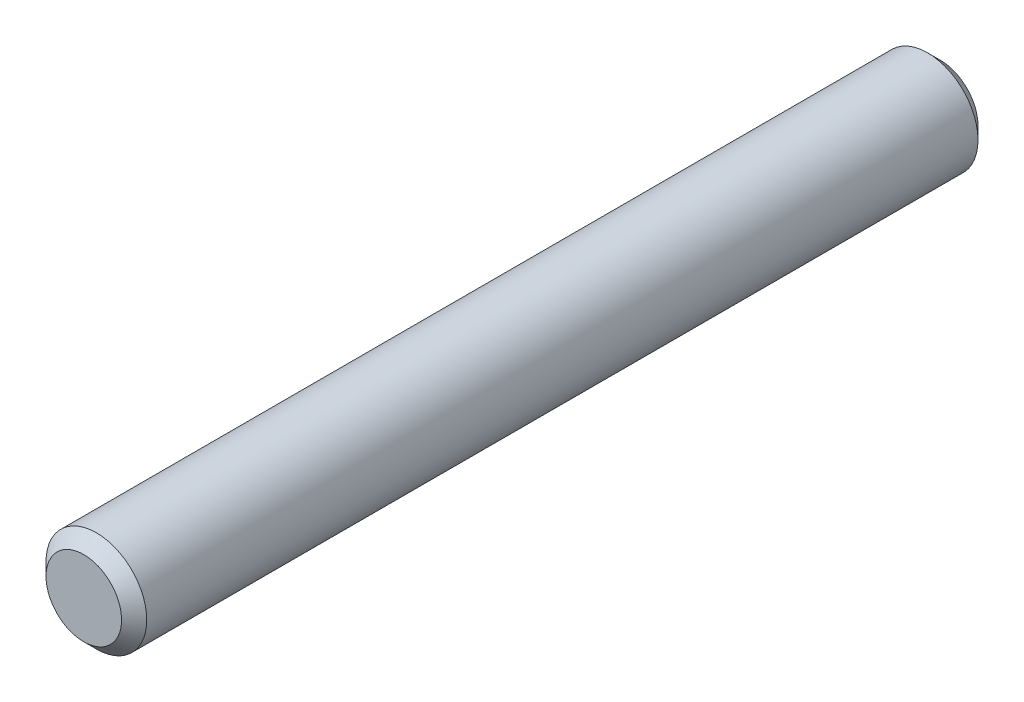
ISO-10303-21;
HEADER;
FILE_DESCRIPTION(('STEP AP214'),'2;1');
FILE_NAME('part.step','',(''),(''),'','','');
FILE_SCHEMA(('AUTOMOTIVE_DESIGN { 1 0 10303 214 1 1 1 1 }'));
ENDSEC;
DATA;
#1=APPLICATION_CONTEXT('core data for automotive mechanical design processes');
#2=APPLICATION_PROTOCOL_DEFINITION('international standard','automotive_design',2000,#1);
#3=PRODUCT_CONTEXT('',#1,'mechanical');
#4=PRODUCT('Part','Part','',(#3));
#5=PRODUCT_RELATED_PRODUCT_CATEGORY('part','',(#4));
#6=PRODUCT_DEFINITION_FORMATION('','',#4);
#7=PRODUCT_DEFINITION_CONTEXT('part definition',#1,'design');
#8=PRODUCT_DEFINITION('design','',#6,#7);
#9=PRODUCT_DEFINITION_SHAPE('','',#8);
#10=(LENGTH_UNIT() NAMED_UNIT(*) SI_UNIT(.MILLI.,.METRE.));
#11=(NAMED_UNIT(*) PLANE_ANGLE_UNIT() SI_UNIT($,.RADIAN.));
#12=(NAMED_UNIT(*) SI_UNIT($,.STERADIAN.) SOLID_ANGLE_UNIT());
#13=UNCERTAINTY_MEASURE_WITH_UNIT(LENGTH_MEASURE(1.E-05),#10,'distance_accuracy_value','');
#14=(GEOMETRIC_REPRESENTATION_CONTEXT(3) GLOBAL_UNCERTAINTY_ASSIGNED_CONTEXT((#13)) GLOBAL_UNIT_ASSIGNED_CONTEXT((#10,
#11,#12)) REPRESENTATION_CONTEXT('',''));
#15=CARTESIAN_POINT('',(0.,0.,0.));
#16=DIRECTION('',(0.,0.,1.));
#17=DIRECTION('',(1.,0.,0.));
#18=AXIS2_PLACEMENT_3D('',#15,#16,#17);
#19=CARTESIAN_POINT('',(0.,0.,-17.));
#20=DIRECTION('',(0.,0.,1.));
#21=DIRECTION('',(1.,0.,0.));
#22=AXIS2_PLACEMENT_3D('',#19,#20,#21);
#23=PLANE('',#22);
#24=CARTESIAN_POINT('',(0.,0.,-17.0000000000528));
#25=DIRECTION('',(0.,0.,1.));
#26=DIRECTION('',(1.,0.,0.));
#27=AXIS2_PLACEMENT_3D('',#24,#25,#26);
#28=CIRCLE('',#27,1.49999999996453);
#29=CARTESIAN_POINT('',(1.49999999996453,0.,-17.0000000000528));
#30=VERTEX_POINT('',#29);
#31=EDGE_CURVE('E18',#30,#30,#28,.T.);
#32=ORIENTED_EDGE('',*,*,#31,.F.);
#33=EDGE_LOOP('',(#32));
#34=FACE_BOUND('',#33,.T.);
#35=ADVANCED_FACE('F15',(#34),#23,.F.);
#36=CARTESIAN_POINT('',(0.,0.,17.));
#37=DIRECTION('',(0.,0.,1.));
#38=DIRECTION('',(1.,0.,0.));
#39=AXIS2_PLACEMENT_3D('',#36,#37,#38);
#40=PLANE('',#39);
#41=CARTESIAN_POINT('',(0.,0.,17.0000000000528));
#42=DIRECTION('',(0.,0.,-1.));
#43=DIRECTION('',(-1.,0.,0.));
#44=AXIS2_PLACEMENT_3D('',#41,#42,#43);
#45=CIRCLE('',#44,1.49999999996453);
#46=CARTESIAN_POINT('',(-1.49999999996453,0.,17.0000000000528));
#47=VERTEX_POINT('',#46);
#48=EDGE_CURVE('E27',#47,#47,#45,.T.);
#49=ORIENTED_EDGE('',*,*,#48,.F.);
#50=EDGE_LOOP('',(#49));
#51=FACE_BOUND('',#50,.T.);
#52=ADVANCED_FACE('F38',(#51),#40,.T.);
#53=CARTESIAN_POINT('',(0.,0.,-16.5000000000646));
#54=DIRECTION('',(0.,0.,1.));
#55=DIRECTION('',(1.,0.,0.));
#56=AXIS2_PLACEMENT_3D('',#53,#54,#55);
#57=CONICAL_SURFACE('',#56,1.99999999995271,0.785398163397448);
#58=CARTESIAN_POINT('',(0.,0.,-16.5));
#59=DIRECTION('',(0.,0.,1.));
#60=DIRECTION('',(1.,0.,0.));
#61=AXIS2_PLACEMENT_3D('',#58,#59,#60);
#62=CIRCLE('',#61,2.);
#63=CARTESIAN_POINT('',(2.,0.,-16.5));
#64=VERTEX_POINT('',#63);
#65=EDGE_CURVE('E22',#64,#64,#62,.T.);
#66=ORIENTED_EDGE('',*,*,#65,.F.);
#67=EDGE_LOOP('',(#66));
#68=FACE_BOUND('',#67,.T.);
#69=ORIENTED_EDGE('',*,*,#31,.T.);
#70=EDGE_LOOP('',(#69));
#71=FACE_BOUND('',#70,.T.);
#72=ADVANCED_FACE('F35',(#68,#71),#57,.T.);
#73=CARTESIAN_POINT('',(0.,0.,16.5000000000646));
#74=DIRECTION('',(0.,0.,-1.));
#75=DIRECTION('',(-1.,0.,0.));
#76=AXIS2_PLACEMENT_3D('',#73,#74,#75);
#77=CONICAL_SURFACE('',#76,1.99999999995271,0.785398163397448);
#78=CARTESIAN_POINT('',(0.,0.,16.5));
#79=DIRECTION('',(0.,0.,1.));
#80=DIRECTION('',(1.,0.,0.));
#81=AXIS2_PLACEMENT_3D('',#78,#79,#80);
#82=CIRCLE('',#81,2.);
#83=CARTESIAN_POINT('',(2.,0.,16.5));
#84=VERTEX_POINT('',#83);
#85=EDGE_CURVE('E10',#84,#84,#82,.F.);
#86=ORIENTED_EDGE('',*,*,#85,.F.);
#87=EDGE_LOOP('',(#86));
#88=FACE_BOUND('',#87,.T.);
#89=ORIENTED_EDGE('',*,*,#48,.T.);
#90=EDGE_LOOP('',(#89));
#91=FACE_BOUND('',#90,.T.);
#92=ADVANCED_FACE('F46',(#88,#91),#77,.T.);
#93=CARTESIAN_POINT('',(0.,0.,-17.));
#94=DIRECTION('',(0.,0.,1.));
#95=DIRECTION('',(1.,0.,0.));
#96=AXIS2_PLACEMENT_3D('',#93,#94,#95);
#97=CYLINDRICAL_SURFACE('',#96,2.);
#98=ORIENTED_EDGE('',*,*,#85,.T.);
#99=EDGE_LOOP('',(#98));
#100=FACE_BOUND('',#99,.T.);
#101=ORIENTED_EDGE('',*,*,#65,.T.);
#102=EDGE_LOOP('',(#101));
#103=FACE_BOUND('',#102,.T.);
#104=ADVANCED_FACE('F44',(#100,#103),#97,.T.);
#105=CLOSED_SHELL('',(#35,#52,#72,#92,#104));
#106=MANIFOLD_SOLID_BREP('B1',#105);
#107=ADVANCED_BREP_SHAPE_REPRESENTATION('',(#18,#106),#14);
#108=SHAPE_DEFINITION_REPRESENTATION(#9,#107);
ENDSEC;
END-ISO-10303-21;
